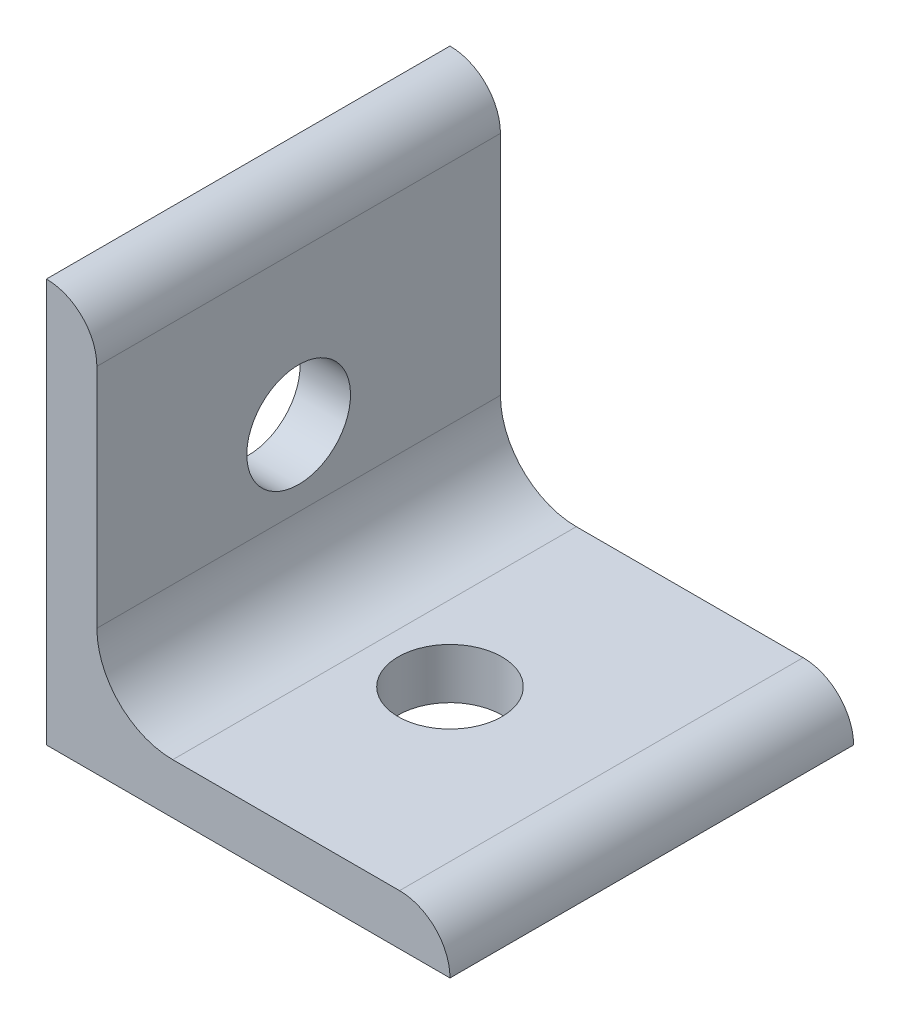
ISO-10303-21;
HEADER;
FILE_DESCRIPTION(('STEP AP214'),'2;1');
FILE_NAME('part.step','',(''),(''),'','','');
FILE_SCHEMA(('AUTOMOTIVE_DESIGN { 1 0 10303 214 1 1 1 1 }'));
ENDSEC;
DATA;
#1=APPLICATION_CONTEXT('core data for automotive mechanical design processes');
#2=APPLICATION_PROTOCOL_DEFINITION('international standard','automotive_design',2000,#1);
#3=PRODUCT_CONTEXT('',#1,'mechanical');
#4=PRODUCT('Part','Part','',(#3));
#5=PRODUCT_RELATED_PRODUCT_CATEGORY('part','',(#4));
#6=PRODUCT_DEFINITION_FORMATION('','',#4);
#7=PRODUCT_DEFINITION_CONTEXT('part definition',#1,'design');
#8=PRODUCT_DEFINITION('design','',#6,#7);
#9=PRODUCT_DEFINITION_SHAPE('','',#8);
#10=(LENGTH_UNIT() NAMED_UNIT(*) SI_UNIT(.MILLI.,.METRE.));
#11=(NAMED_UNIT(*) PLANE_ANGLE_UNIT() SI_UNIT($,.RADIAN.));
#12=(NAMED_UNIT(*) SI_UNIT($,.STERADIAN.) SOLID_ANGLE_UNIT());
#13=UNCERTAINTY_MEASURE_WITH_UNIT(LENGTH_MEASURE(1.E-05),#10,'distance_accuracy_value','');
#14=(GEOMETRIC_REPRESENTATION_CONTEXT(3) GLOBAL_UNCERTAINTY_ASSIGNED_CONTEXT((#13)) GLOBAL_UNIT_ASSIGNED_CONTEXT((#10,
#11,#12)) REPRESENTATION_CONTEXT('',''));
#15=CARTESIAN_POINT('',(0.,0.,0.));
#16=DIRECTION('',(0.,0.,1.));
#17=DIRECTION('',(1.,0.,0.));
#18=AXIS2_PLACEMENT_3D('',#15,#16,#17);
#19=CARTESIAN_POINT('',(23.47304696449,-4.87140320733104,25.4));
#20=DIRECTION('',(0.,0.,-1.));
#21=DIRECTION('',(-1.,0.,0.));
#22=AXIS2_PLACEMENT_3D('',#19,#20,#21);
#23=CYLINDRICAL_SURFACE('',#22,3.175);
#24=CARTESIAN_POINT('',(23.47304696449,-4.87140320733104,0.));
#25=DIRECTION('',(0.,0.,1.));
#26=DIRECTION('',(-1.,0.,0.));
#27=AXIS2_PLACEMENT_3D('',#24,#25,#26);
#28=CIRCLE('',#27,3.175);
#29=CARTESIAN_POINT('',(26.64804696449,-4.87140320733099,0.));
#30=VERTEX_POINT('',#29);
#31=CARTESIAN_POINT('',(23.47304696449,-1.69640320733104,0.));
#32=VERTEX_POINT('',#31);
#33=EDGE_CURVE('E124',#30,#32,#28,.T.);
#34=ORIENTED_EDGE('',*,*,#33,.T.);
#35=DIRECTION('',(0.,0.,-1.));
#36=VECTOR('',#35,1.);
#37=CARTESIAN_POINT('',(23.47304696449,-1.69640320733104,25.4));
#38=LINE('',#37,#36);
#39=CARTESIAN_POINT('',(23.47304696449,-1.69640320733104,25.4));
#40=VERTEX_POINT('',#39);
#41=EDGE_CURVE('E11',#40,#32,#38,.T.);
#42=ORIENTED_EDGE('',*,*,#41,.F.);
#43=CARTESIAN_POINT('',(23.47304696449,-4.87140320733104,25.4));
#44=DIRECTION('',(0.,0.,1.));
#45=DIRECTION('',(-1.,0.,0.));
#46=AXIS2_PLACEMENT_3D('',#43,#44,#45);
#47=CIRCLE('',#46,3.175);
#48=CARTESIAN_POINT('',(26.64804696449,-4.87140320733099,25.4));
#49=VERTEX_POINT('',#48);
#50=EDGE_CURVE('E137',#49,#40,#47,.T.);
#51=ORIENTED_EDGE('',*,*,#50,.F.);
#52=DIRECTION('',(0.,0.,-1.));
#53=VECTOR('',#52,1.);
#54=CARTESIAN_POINT('',(26.64804696449,-4.87140320733099,25.4));
#55=LINE('',#54,#53);
#56=EDGE_CURVE('E120',#49,#30,#55,.T.);
#57=ORIENTED_EDGE('',*,*,#56,.T.);
#58=EDGE_LOOP('',(#34,#42,#51,#57));
#59=FACE_BOUND('',#58,.T.);
#60=ADVANCED_FACE('F32',(#59),#23,.T.);
#61=CARTESIAN_POINT('',(23.47304696449,-1.69640320733104,25.4));
#62=DIRECTION('',(1.,0.,0.));
#63=DIRECTION('',(0.,1.,0.));
#64=AXIS2_PLACEMENT_3D('',#61,#62,#63);
#65=PLANE('',#64);
#66=CARTESIAN_POINT('',(23.47304696449,-14.396403207331,12.7));
#67=DIRECTION('',(-1.,0.,0.));
#68=DIRECTION('',(0.,-1.,0.));
#69=AXIS2_PLACEMENT_3D('',#66,#67,#68);
#70=CIRCLE('',#69,3.2639);
#71=CARTESIAN_POINT('',(23.47304696449,-17.660303207331,12.7));
#72=VERTEX_POINT('',#71);
#73=EDGE_CURVE('E146',#72,#72,#70,.T.);
#74=ORIENTED_EDGE('',*,*,#73,.F.);
#75=EDGE_LOOP('',(#74));
#76=FACE_BOUND('',#75,.T.);
#77=DIRECTION('',(0.,-1.,0.));
#78=VECTOR('',#77,1.);
#79=CARTESIAN_POINT('',(23.47304696449,-1.69640320733104,0.));
#80=LINE('',#79,#78);
#81=CARTESIAN_POINT('',(23.47304696449,-27.096403207331,0.));
#82=VERTEX_POINT('',#81);
#83=EDGE_CURVE('E127',#32,#82,#80,.T.);
#84=ORIENTED_EDGE('',*,*,#83,.T.);
#85=DIRECTION('',(0.,0.,-1.));
#86=VECTOR('',#85,1.);
#87=CARTESIAN_POINT('',(23.47304696449,-27.096403207331,25.4));
#88=LINE('',#87,#86);
#89=CARTESIAN_POINT('',(23.47304696449,-27.096403207331,25.4));
#90=VERTEX_POINT('',#89);
#91=EDGE_CURVE('E41',#90,#82,#88,.T.);
#92=ORIENTED_EDGE('',*,*,#91,.F.);
#93=DIRECTION('',(0.,-1.,0.));
#94=VECTOR('',#93,1.);
#95=CARTESIAN_POINT('',(23.47304696449,-1.69640320733104,25.4));
#96=LINE('',#95,#94);
#97=EDGE_CURVE('E90',#40,#90,#96,.T.);
#98=ORIENTED_EDGE('',*,*,#97,.F.);
#99=ORIENTED_EDGE('',*,*,#41,.T.);
#100=EDGE_LOOP('',(#84,#92,#98,#99));
#101=FACE_BOUND('',#100,.T.);
#102=ADVANCED_FACE('F185',(#76,#101),#65,.F.);
#103=CARTESIAN_POINT('',(23.47304696449,-27.096403207331,25.4));
#104=DIRECTION('',(0.,1.,0.));
#105=DIRECTION('',(0.,0.,1.));
#106=AXIS2_PLACEMENT_3D('',#103,#104,#105);
#107=PLANE('',#106);
#108=CARTESIAN_POINT('',(36.1730469644901,-27.096403207331,12.7));
#109=DIRECTION('',(0.,-1.,0.));
#110=DIRECTION('',(0.,0.,-1.));
#111=AXIS2_PLACEMENT_3D('',#108,#109,#110);
#112=CIRCLE('',#111,3.2639);
#113=CARTESIAN_POINT('',(36.1730469644901,-27.096403207331,9.4361));
#114=VERTEX_POINT('',#113);
#115=EDGE_CURVE('E154',#114,#114,#112,.T.);
#116=ORIENTED_EDGE('',*,*,#115,.F.);
#117=EDGE_LOOP('',(#116));
#118=FACE_BOUND('',#117,.T.);
#119=DIRECTION('',(1.,0.,0.));
#120=VECTOR('',#119,1.);
#121=CARTESIAN_POINT('',(23.47304696449,-27.096403207331,0.));
#122=LINE('',#121,#120);
#123=CARTESIAN_POINT('',(48.8730469644903,-27.096403207331,0.));
#124=VERTEX_POINT('',#123);
#125=EDGE_CURVE('E130',#82,#124,#122,.T.);
#126=ORIENTED_EDGE('',*,*,#125,.T.);
#127=DIRECTION('',(0.,0.,-1.));
#128=VECTOR('',#127,1.);
#129=CARTESIAN_POINT('',(48.8730469644903,-27.096403207331,25.4));
#130=LINE('',#129,#128);
#131=CARTESIAN_POINT('',(48.8730469644903,-27.096403207331,25.4));
#132=VERTEX_POINT('',#131);
#133=EDGE_CURVE('E141',#132,#124,#130,.T.);
#134=ORIENTED_EDGE('',*,*,#133,.F.);
#135=DIRECTION('',(1.,0.,0.));
#136=VECTOR('',#135,1.);
#137=CARTESIAN_POINT('',(23.47304696449,-27.096403207331,25.4));
#138=LINE('',#137,#136);
#139=EDGE_CURVE('E159',#90,#132,#138,.T.);
#140=ORIENTED_EDGE('',*,*,#139,.F.);
#141=ORIENTED_EDGE('',*,*,#91,.T.);
#142=EDGE_LOOP('',(#126,#134,#140,#141));
#143=FACE_BOUND('',#142,.T.);
#144=ADVANCED_FACE('F163',(#118,#143),#107,.F.);
#145=CARTESIAN_POINT('',(45.6980469644903,-27.0964032073305,25.4));
#146=DIRECTION('',(0.,0.,-1.));
#147=DIRECTION('',(-1.,0.,0.));
#148=AXIS2_PLACEMENT_3D('',#145,#146,#147);
#149=CYLINDRICAL_SURFACE('',#148,3.17499999999999);
#150=CARTESIAN_POINT('',(45.6980469644903,-27.0964032073305,0.));
#151=DIRECTION('',(0.,0.,1.));
#152=DIRECTION('',(-1.,0.,0.));
#153=AXIS2_PLACEMENT_3D('',#150,#151,#152);
#154=CIRCLE('',#153,3.17499999999999);
#155=CARTESIAN_POINT('',(45.6980469644902,-23.9214032073305,0.));
#156=VERTEX_POINT('',#155);
#157=EDGE_CURVE('E132',#124,#156,#154,.T.);
#158=ORIENTED_EDGE('',*,*,#157,.T.);
#159=DIRECTION('',(0.,0.,-1.));
#160=VECTOR('',#159,1.);
#161=CARTESIAN_POINT('',(45.6980469644902,-23.9214032073305,25.4));
#162=LINE('',#161,#160);
#163=CARTESIAN_POINT('',(45.6980469644902,-23.9214032073305,25.4));
#164=VERTEX_POINT('',#163);
#165=EDGE_CURVE('E115',#164,#156,#162,.T.);
#166=ORIENTED_EDGE('',*,*,#165,.F.);
#167=CARTESIAN_POINT('',(45.6980469644903,-27.0964032073305,25.4));
#168=DIRECTION('',(0.,0.,1.));
#169=DIRECTION('',(-1.,0.,0.));
#170=AXIS2_PLACEMENT_3D('',#167,#168,#169);
#171=CIRCLE('',#170,3.17499999999999);
#172=EDGE_CURVE('E106',#132,#164,#171,.T.);
#173=ORIENTED_EDGE('',*,*,#172,.F.);
#174=ORIENTED_EDGE('',*,*,#133,.T.);
#175=EDGE_LOOP('',(#158,#166,#173,#174));
#176=FACE_BOUND('',#175,.T.);
#177=ADVANCED_FACE('F167',(#176),#149,.T.);
#178=CARTESIAN_POINT('',(45.6980469644902,-23.9214032073305,25.4));
#179=DIRECTION('',(0.,-1.,0.));
#180=DIRECTION('',(1.,0.,0.));
#181=AXIS2_PLACEMENT_3D('',#178,#179,#180);
#182=PLANE('',#181);
#183=CARTESIAN_POINT('',(36.1730469644901,-23.9214032073307,12.7));
#184=DIRECTION('',(0.,-1.,0.));
#185=DIRECTION('',(1.,0.,0.));
#186=AXIS2_PLACEMENT_3D('',#183,#184,#185);
#187=CIRCLE('',#186,3.2639);
#188=CARTESIAN_POINT('',(39.4369469644901,-23.9214032073307,12.7));
#189=VERTEX_POINT('',#188);
#190=EDGE_CURVE('E35',#189,#189,#187,.T.);
#191=ORIENTED_EDGE('',*,*,#190,.T.);
#192=EDGE_LOOP('',(#191));
#193=FACE_BOUND('',#192,.T.);
#194=DIRECTION('',(-1.,0.,0.));
#195=VECTOR('',#194,1.);
#196=CARTESIAN_POINT('',(45.6980469644902,-23.9214032073305,0.));
#197=LINE('',#196,#195);
#198=CARTESIAN_POINT('',(31.4232469644903,-23.9214032073309,0.));
#199=VERTEX_POINT('',#198);
#200=EDGE_CURVE('E114',#156,#199,#197,.T.);
#201=ORIENTED_EDGE('',*,*,#200,.T.);
#202=DIRECTION('',(0.,0.,-1.));
#203=VECTOR('',#202,1.);
#204=CARTESIAN_POINT('',(31.4232469644903,-23.9214032073309,25.4));
#205=LINE('',#204,#203);
#206=CARTESIAN_POINT('',(31.4232469644903,-23.9214032073309,25.4));
#207=VERTEX_POINT('',#206);
#208=EDGE_CURVE('E111',#207,#199,#205,.T.);
#209=ORIENTED_EDGE('',*,*,#208,.F.);
#210=DIRECTION('',(-1.,0.,0.));
#211=VECTOR('',#210,1.);
#212=CARTESIAN_POINT('',(45.6980469644902,-23.9214032073305,25.4));
#213=LINE('',#212,#211);
#214=EDGE_CURVE('E100',#164,#207,#213,.T.);
#215=ORIENTED_EDGE('',*,*,#214,.F.);
#216=ORIENTED_EDGE('',*,*,#165,.T.);
#217=EDGE_LOOP('',(#201,#209,#215,#216));
#218=FACE_BOUND('',#217,.T.);
#219=ADVANCED_FACE('F112',(#193,#218),#182,.F.);
#220=CARTESIAN_POINT('',(31.4232469644902,-19.1462032073308,25.4));
#221=DIRECTION('',(0.,0.,-1.));
#222=DIRECTION('',(-1.,0.,0.));
#223=AXIS2_PLACEMENT_3D('',#220,#221,#222);
#224=CYLINDRICAL_SURFACE('',#223,4.7752);
#225=CARTESIAN_POINT('',(31.4232469644902,-19.1462032073308,0.));
#226=DIRECTION('',(0.,0.,-1.));
#227=DIRECTION('',(-1.,0.,0.));
#228=AXIS2_PLACEMENT_3D('',#225,#226,#227);
#229=CIRCLE('',#228,4.7752);
#230=CARTESIAN_POINT('',(26.6480469644902,-19.1462032073309,0.));
#231=VERTEX_POINT('',#230);
#232=EDGE_CURVE('E76',#199,#231,#229,.T.);
#233=ORIENTED_EDGE('',*,*,#232,.T.);
#234=DIRECTION('',(0.,0.,-1.));
#235=VECTOR('',#234,1.);
#236=CARTESIAN_POINT('',(26.6480469644902,-19.1462032073309,25.4));
#237=LINE('',#236,#235);
#238=CARTESIAN_POINT('',(26.6480469644902,-19.1462032073309,25.4));
#239=VERTEX_POINT('',#238);
#240=EDGE_CURVE('E116',#239,#231,#237,.T.);
#241=ORIENTED_EDGE('',*,*,#240,.F.);
#242=CARTESIAN_POINT('',(31.4232469644902,-19.1462032073308,25.4));
#243=DIRECTION('',(0.,0.,-1.));
#244=DIRECTION('',(-1.,0.,0.));
#245=AXIS2_PLACEMENT_3D('',#242,#243,#244);
#246=CIRCLE('',#245,4.7752);
#247=EDGE_CURVE('E104',#207,#239,#246,.T.);
#248=ORIENTED_EDGE('',*,*,#247,.F.);
#249=ORIENTED_EDGE('',*,*,#208,.T.);
#250=EDGE_LOOP('',(#233,#241,#248,#249));
#251=FACE_BOUND('',#250,.T.);
#252=ADVANCED_FACE('F118',(#251),#224,.F.);
#253=CARTESIAN_POINT('',(26.6480469644902,-19.1462032073309,25.4));
#254=DIRECTION('',(-1.,0.,0.));
#255=DIRECTION('',(0.,-1.,0.));
#256=AXIS2_PLACEMENT_3D('',#253,#254,#255);
#257=PLANE('',#256);
#258=CARTESIAN_POINT('',(26.6480469644901,-14.396403207331,12.7));
#259=DIRECTION('',(-1.,0.,0.));
#260=DIRECTION('',(0.,-1.,0.));
#261=AXIS2_PLACEMENT_3D('',#258,#259,#260);
#262=CIRCLE('',#261,3.2639);
#263=CARTESIAN_POINT('',(26.6480469644902,-17.660303207331,12.7));
#264=VERTEX_POINT('',#263);
#265=EDGE_CURVE('E128',#264,#264,#262,.T.);
#266=ORIENTED_EDGE('',*,*,#265,.T.);
#267=EDGE_LOOP('',(#266));
#268=FACE_BOUND('',#267,.T.);
#269=DIRECTION('',(0.,1.,0.));
#270=VECTOR('',#269,1.);
#271=CARTESIAN_POINT('',(26.6480469644902,-19.1462032073309,0.));
#272=LINE('',#271,#270);
#273=EDGE_CURVE('E82',#231,#30,#272,.T.);
#274=ORIENTED_EDGE('',*,*,#273,.T.);
#275=ORIENTED_EDGE('',*,*,#56,.F.);
#276=DIRECTION('',(0.,1.,0.));
#277=VECTOR('',#276,1.);
#278=CARTESIAN_POINT('',(26.6480469644902,-19.1462032073309,25.4));
#279=LINE('',#278,#277);
#280=EDGE_CURVE('E50',#239,#49,#279,.T.);
#281=ORIENTED_EDGE('',*,*,#280,.F.);
#282=ORIENTED_EDGE('',*,*,#240,.T.);
#283=EDGE_LOOP('',(#274,#275,#281,#282));
#284=FACE_BOUND('',#283,.T.);
#285=ADVANCED_FACE('F174',(#268,#284),#257,.F.);
#286=CARTESIAN_POINT('',(23.47304696449,-4.87140320733104,25.4));
#287=DIRECTION('',(0.,0.,-1.));
#288=DIRECTION('',(-1.,0.,0.));
#289=AXIS2_PLACEMENT_3D('',#286,#287,#288);
#290=PLANE('',#289);
#291=ORIENTED_EDGE('',*,*,#50,.T.);
#292=ORIENTED_EDGE('',*,*,#97,.T.);
#293=ORIENTED_EDGE('',*,*,#139,.T.);
#294=ORIENTED_EDGE('',*,*,#172,.T.);
#295=ORIENTED_EDGE('',*,*,#214,.T.);
#296=ORIENTED_EDGE('',*,*,#247,.T.);
#297=ORIENTED_EDGE('',*,*,#280,.T.);
#298=EDGE_LOOP('',(#291,#292,#293,#294,#295,#296,#297));
#299=FACE_BOUND('',#298,.T.);
#300=ADVANCED_FACE('F102',(#299),#290,.F.);
#301=CARTESIAN_POINT('',(23.47304696449,-4.87140320733104,0.));
#302=DIRECTION('',(0.,0.,-1.));
#303=DIRECTION('',(-1.,0.,0.));
#304=AXIS2_PLACEMENT_3D('',#301,#302,#303);
#305=PLANE('',#304);
#306=ORIENTED_EDGE('',*,*,#33,.F.);
#307=ORIENTED_EDGE('',*,*,#273,.F.);
#308=ORIENTED_EDGE('',*,*,#232,.F.);
#309=ORIENTED_EDGE('',*,*,#200,.F.);
#310=ORIENTED_EDGE('',*,*,#157,.F.);
#311=ORIENTED_EDGE('',*,*,#125,.F.);
#312=ORIENTED_EDGE('',*,*,#83,.F.);
#313=EDGE_LOOP('',(#306,#307,#308,#309,#310,#311,#312));
#314=FACE_BOUND('',#313,.T.);
#315=ADVANCED_FACE('F170',(#314),#305,.T.);
#316=CARTESIAN_POINT('',(48.8730469644903,-14.396403207331,12.7));
#317=DIRECTION('',(-1.,0.,0.));
#318=DIRECTION('',(0.,-1.,0.));
#319=AXIS2_PLACEMENT_3D('',#316,#317,#318);
#320=CYLINDRICAL_SURFACE('',#319,3.2639);
#321=ORIENTED_EDGE('',*,*,#73,.T.);
#322=EDGE_LOOP('',(#321));
#323=FACE_BOUND('',#322,.T.);
#324=ORIENTED_EDGE('',*,*,#265,.F.);
#325=EDGE_LOOP('',(#324));
#326=FACE_BOUND('',#325,.T.);
#327=ADVANCED_FACE('F206',(#323,#326),#320,.F.);
#328=CARTESIAN_POINT('',(36.1730469644901,-1.69640320733104,12.7));
#329=DIRECTION('',(0.,-1.,0.));
#330=DIRECTION('',(0.,0.,-1.));
#331=AXIS2_PLACEMENT_3D('',#328,#329,#330);
#332=CYLINDRICAL_SURFACE('',#331,3.2639);
#333=ORIENTED_EDGE('',*,*,#115,.T.);
#334=EDGE_LOOP('',(#333));
#335=FACE_BOUND('',#334,.T.);
#336=ORIENTED_EDGE('',*,*,#190,.F.);
#337=EDGE_LOOP('',(#336));
#338=FACE_BOUND('',#337,.T.);
#339=ADVANCED_FACE('F204',(#335,#338),#332,.F.);
#340=CLOSED_SHELL('',(#60,#102,#144,#177,#219,#252,#285,#300,#315,#327,#339));
#341=MANIFOLD_SOLID_BREP('B2',#340);
#342=ADVANCED_BREP_SHAPE_REPRESENTATION('',(#18,#341),#14);
#343=SHAPE_DEFINITION_REPRESENTATION(#9,#342);
ENDSEC;
END-ISO-10303-21;
